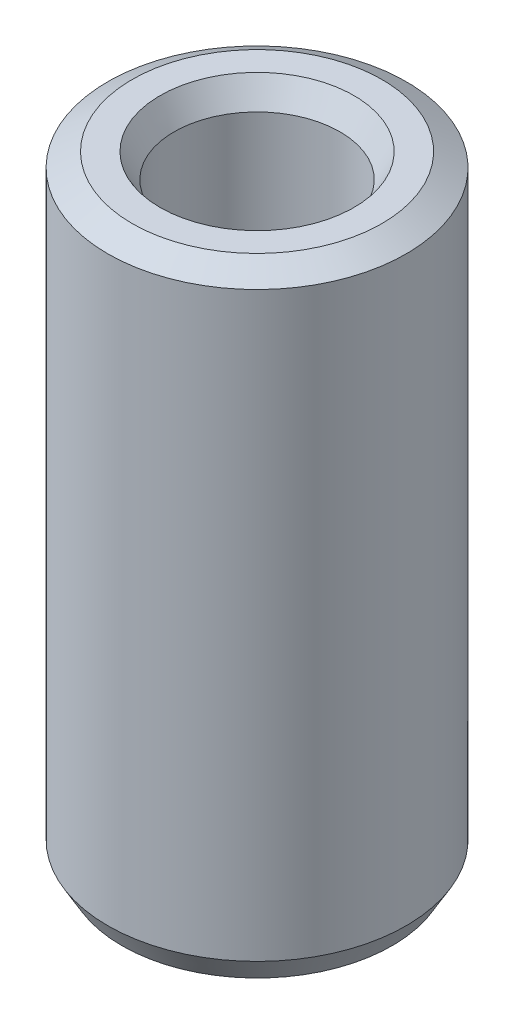
ISO-10303-21;
HEADER;
FILE_DESCRIPTION(('STEP AP214'),'2;1');
FILE_NAME('part.step','',(''),(''),'','','');
FILE_SCHEMA(('AUTOMOTIVE_DESIGN { 1 0 10303 214 1 1 1 1 }'));
ENDSEC;
DATA;
#1=APPLICATION_CONTEXT('core data for automotive mechanical design processes');
#2=APPLICATION_PROTOCOL_DEFINITION('international standard','automotive_design',2000,#1);
#3=PRODUCT_CONTEXT('',#1,'mechanical');
#4=PRODUCT('Part','Part','',(#3));
#5=PRODUCT_RELATED_PRODUCT_CATEGORY('part','',(#4));
#6=PRODUCT_DEFINITION_FORMATION('','',#4);
#7=PRODUCT_DEFINITION_CONTEXT('part definition',#1,'design');
#8=PRODUCT_DEFINITION('design','',#6,#7);
#9=PRODUCT_DEFINITION_SHAPE('','',#8);
#10=(LENGTH_UNIT() NAMED_UNIT(*) SI_UNIT(.MILLI.,.METRE.));
#11=(NAMED_UNIT(*) PLANE_ANGLE_UNIT() SI_UNIT($,.RADIAN.));
#12=(NAMED_UNIT(*) SI_UNIT($,.STERADIAN.) SOLID_ANGLE_UNIT());
#13=UNCERTAINTY_MEASURE_WITH_UNIT(LENGTH_MEASURE(1.E-05),#10,'distance_accuracy_value','');
#14=(GEOMETRIC_REPRESENTATION_CONTEXT(3) GLOBAL_UNCERTAINTY_ASSIGNED_CONTEXT((#13)) GLOBAL_UNIT_ASSIGNED_CONTEXT((#10,
#11,#12)) REPRESENTATION_CONTEXT('',''));
#15=CARTESIAN_POINT('',(0.,0.,0.));
#16=DIRECTION('',(0.,0.,1.));
#17=DIRECTION('',(1.,0.,0.));
#18=AXIS2_PLACEMENT_3D('',#15,#16,#17);
#19=CARTESIAN_POINT('',(0.,20.7877151218434,0.));
#20=DIRECTION('',(0.,-1.,0.));
#21=DIRECTION('',(0.,0.,-1.));
#22=AXIS2_PLACEMENT_3D('',#19,#20,#21);
#23=CYLINDRICAL_SURFACE('',#22,5.);
#24=CARTESIAN_POINT('',(0.,0.815561076409597,0.));
#25=DIRECTION('',(0.,1.,0.));
#26=DIRECTION('',(0.,0.,1.));
#27=AXIS2_PLACEMENT_3D('',#24,#25,#26);
#28=CIRCLE('',#27,5.);
#29=CARTESIAN_POINT('',(0.,0.815561076409597,5.));
#30=VERTEX_POINT('',#29);
#31=EDGE_CURVE('E10',#30,#30,#28,.T.);
#32=ORIENTED_EDGE('',*,*,#31,.T.);
#33=EDGE_LOOP('',(#32));
#34=FACE_BOUND('',#33,.T.);
#35=CARTESIAN_POINT('',(0.,20.3168507148377,0.));
#36=DIRECTION('',(0.,1.,0.));
#37=DIRECTION('',(0.,0.,1.));
#38=AXIS2_PLACEMENT_3D('',#35,#36,#37);
#39=CIRCLE('',#38,5.);
#40=CARTESIAN_POINT('',(0.,20.3168507148377,5.));
#41=VERTEX_POINT('',#40);
#42=EDGE_CURVE('E50',#41,#41,#39,.F.);
#43=ORIENTED_EDGE('',*,*,#42,.T.);
#44=EDGE_LOOP('',(#43));
#45=FACE_BOUND('',#44,.T.);
#46=ADVANCED_FACE('F39',(#34,#45),#23,.T.);
#47=CARTESIAN_POINT('',(0.,20.7877151218434,0.));
#48=DIRECTION('',(0.,1.,0.));
#49=DIRECTION('',(0.,0.,1.));
#50=AXIS2_PLACEMENT_3D('',#47,#48,#49);
#51=PLANE('',#50);
#52=CARTESIAN_POINT('',(0.,20.7877151218434,0.));
#53=DIRECTION('',(0.,1.,0.));
#54=DIRECTION('',(0.,0.,1.));
#55=AXIS2_PLACEMENT_3D('',#52,#53,#54);
#56=CIRCLE('',#55,3.24967798674538);
#57=CARTESIAN_POINT('',(0.,20.7877151218434,3.24967798674538));
#58=VERTEX_POINT('',#57);
#59=EDGE_CURVE('E58',#58,#58,#56,.F.);
#60=ORIENTED_EDGE('',*,*,#59,.T.);
#61=EDGE_LOOP('',(#60));
#62=FACE_BOUND('',#61,.T.);
#63=CARTESIAN_POINT('',(0.,20.7877151218434,0.));
#64=DIRECTION('',(0.,1.,0.));
#65=DIRECTION('',(0.,0.,1.));
#66=AXIS2_PLACEMENT_3D('',#63,#64,#65);
#67=CIRCLE('',#66,4.1844389235904);
#68=CARTESIAN_POINT('',(0.,20.7877151218434,4.1844389235904));
#69=VERTEX_POINT('',#68);
#70=EDGE_CURVE('E61',#69,#69,#67,.T.);
#71=ORIENTED_EDGE('',*,*,#70,.T.);
#72=EDGE_LOOP('',(#71));
#73=FACE_BOUND('',#72,.T.);
#74=ADVANCED_FACE('F88',(#62,#73),#51,.T.);
#75=CARTESIAN_POINT('',(0.,0.,0.));
#76=DIRECTION('',(0.,1.,0.));
#77=DIRECTION('',(0.,0.,1.));
#78=AXIS2_PLACEMENT_3D('',#75,#76,#77);
#79=PLANE('',#78);
#80=CARTESIAN_POINT('',(0.,0.,0.));
#81=DIRECTION('',(0.,1.,0.));
#82=DIRECTION('',(0.,0.,1.));
#83=AXIS2_PLACEMENT_3D('',#80,#81,#82);
#84=CIRCLE('',#83,3.59437465614932);
#85=CARTESIAN_POINT('',(0.,0.,-3.59437465614932));
#86=VERTEX_POINT('',#85);
#87=EDGE_CURVE('E51',#86,#86,#84,.T.);
#88=ORIENTED_EDGE('',*,*,#87,.T.);
#89=EDGE_LOOP('',(#88));
#90=FACE_BOUND('',#89,.T.);
#91=CARTESIAN_POINT('',(0.,0.,0.));
#92=DIRECTION('',(0.,1.,0.));
#93=DIRECTION('',(0.,0.,1.));
#94=AXIS2_PLACEMENT_3D('',#91,#92,#93);
#95=CIRCLE('',#94,4.52913559299433);
#96=CARTESIAN_POINT('',(0.,0.,4.52913559299433));
#97=VERTEX_POINT('',#96);
#98=EDGE_CURVE('E54',#97,#97,#95,.F.);
#99=ORIENTED_EDGE('',*,*,#98,.T.);
#100=EDGE_LOOP('',(#99));
#101=FACE_BOUND('',#100,.T.);
#102=ADVANCED_FACE('F83',(#90,#101),#79,.F.);
#103=CARTESIAN_POINT('',(0.,20.7877151218434,0.));
#104=DIRECTION('',(0.,-1.,0.));
#105=DIRECTION('',(0.,0.,-1.));
#106=AXIS2_PLACEMENT_3D('',#103,#104,#105);
#107=CYLINDRICAL_SURFACE('',#106,2.77881357973972);
#108=CARTESIAN_POINT('',(0.,19.9721540454338,0.));
#109=DIRECTION('',(0.,1.,0.));
#110=DIRECTION('',(0.,0.,1.));
#111=AXIS2_PLACEMENT_3D('',#108,#109,#110);
#112=CIRCLE('',#111,2.77881357973972);
#113=CARTESIAN_POINT('',(0.,19.9721540454338,-2.77881357973972));
#114=VERTEX_POINT('',#113);
#115=EDGE_CURVE('E67',#114,#114,#112,.T.);
#116=CARTESIAN_POINT('',(0.,0.470864407005663,0.));
#117=DIRECTION('',(0.,1.,0.));
#118=DIRECTION('',(0.,0.,1.));
#119=AXIS2_PLACEMENT_3D('',#116,#117,#118);
#120=CIRCLE('',#119,2.77881357973972);
#121=CARTESIAN_POINT('',(0.,0.47086440700566,-2.77881357973972));
#122=VERTEX_POINT('',#121);
#123=EDGE_CURVE('E69',#122,#122,#120,.F.);
#124=CARTESIAN_POINT('',(0.,19.9721540454338,-2.77881357973972));
#125=CARTESIAN_POINT('',(0.,19.7690156117001,-2.77881357973972));
#126=CARTESIAN_POINT('',(0.,19.5658771779665,-2.77881357973972));
#127=CARTESIAN_POINT('',(0.,19.1596003104993,-2.77881357973972));
#128=CARTESIAN_POINT('',(0.,18.9564618767656,-2.77881357973972));
#129=CARTESIAN_POINT('',(0.,18.5501850092984,-2.77881357973972));
#130=CARTESIAN_POINT('',(0.,18.3470465755648,-2.77881357973972));
#131=CARTESIAN_POINT('',(0.,17.9407697080975,-2.77881357973972));
#132=CARTESIAN_POINT('',(0.,17.7376312743639,-2.77881357973972));
#133=CARTESIAN_POINT('',(0.,17.3313544068966,-2.77881357973972));
#134=CARTESIAN_POINT('',(0.,17.128215973163,-2.77881357973972));
#135=CARTESIAN_POINT('',(0.,16.7219391056958,-2.77881357973972));
#136=CARTESIAN_POINT('',(0.,16.5188006719621,-2.77881357973972));
#137=CARTESIAN_POINT('',(0.,16.1125238044949,-2.77881357973972));
#138=CARTESIAN_POINT('',(0.,15.9093853707612,-2.77881357973972));
#139=CARTESIAN_POINT('',(0.,15.503108503294,-2.77881357973972));
#140=CARTESIAN_POINT('',(0.,15.2999700695604,-2.77881357973972));
#141=CARTESIAN_POINT('',(0.,14.8936932020931,-2.77881357973972));
#142=CARTESIAN_POINT('',(0.,14.6905547683595,-2.77881357973972));
#143=CARTESIAN_POINT('',(0.,14.2842779008922,-2.77881357973972));
#144=CARTESIAN_POINT('',(0.,14.0811394671586,-2.77881357973972));
#145=CARTESIAN_POINT('',(0.,13.6748625996914,-2.77881357973972));
#146=CARTESIAN_POINT('',(0.,13.4717241659577,-2.77881357973972));
#147=CARTESIAN_POINT('',(0.,13.0654472984905,-2.77881357973972));
#148=CARTESIAN_POINT('',(0.,12.8623088647569,-2.77881357973972));
#149=CARTESIAN_POINT('',(0.,12.4560319972896,-2.77881357973972));
#150=CARTESIAN_POINT('',(0.,12.252893563556,-2.77881357973972));
#151=CARTESIAN_POINT('',(0.,11.8466166960887,-2.77881357973972));
#152=CARTESIAN_POINT('',(0.,11.6434782623551,-2.77881357973972));
#153=CARTESIAN_POINT('',(0.,11.2372013948878,-2.77881357973972));
#154=CARTESIAN_POINT('',(0.,11.0340629611542,-2.77881357973972));
#155=CARTESIAN_POINT('',(0.,10.627786093687,-2.77881357973972));
#156=CARTESIAN_POINT('',(0.,10.4246476599533,-2.77881357973972));
#157=CARTESIAN_POINT('',(0.,10.0183707924861,-2.77881357973972));
#158=CARTESIAN_POINT('',(0.,9.81523235875246,-2.77881357973972));
#159=CARTESIAN_POINT('',(0.,9.40895549128521,-2.77881357973972));
#160=CARTESIAN_POINT('',(0.,9.20581705755158,-2.77881357973972));
#161=CARTESIAN_POINT('',(0.,8.79954019008433,-2.77881357973972));
#162=CARTESIAN_POINT('',(0.,8.5964017563507,-2.77881357973972));
#163=CARTESIAN_POINT('',(0.,8.19012488888345,-2.77881357973972));
#164=CARTESIAN_POINT('',(0.,7.98698645514983,-2.77881357973972));
#165=CARTESIAN_POINT('',(0.,7.58070958768257,-2.77881357973972));
#166=CARTESIAN_POINT('',(0.,7.37757115394895,-2.77881357973972));
#167=CARTESIAN_POINT('',(0.,6.9712942864817,-2.77881357973972));
#168=CARTESIAN_POINT('',(0.,6.76815585274807,-2.77881357973972));
#169=CARTESIAN_POINT('',(0.,6.36187898528082,-2.77881357973972));
#170=CARTESIAN_POINT('',(0.,6.15874055154719,-2.77881357973972));
#171=CARTESIAN_POINT('',(0.,5.75246368407994,-2.77881357973972));
#172=CARTESIAN_POINT('',(0.,5.54932525034631,-2.77881357973972));
#173=CARTESIAN_POINT('',(0.,5.14304838287906,-2.77881357973972));
#174=CARTESIAN_POINT('',(0.,4.93990994914543,-2.77881357973972));
#175=CARTESIAN_POINT('',(0.,4.53363308167818,-2.77881357973972));
#176=CARTESIAN_POINT('',(0.,4.33049464794456,-2.77881357973972));
#177=CARTESIAN_POINT('',(0.,3.92421778047731,-2.77881357973972));
#178=CARTESIAN_POINT('',(0.,3.72107934674368,-2.77881357973972));
#179=CARTESIAN_POINT('',(0.,3.31480247927643,-2.77881357973972));
#180=CARTESIAN_POINT('',(0.,3.1116640455428,-2.77881357973972));
#181=CARTESIAN_POINT('',(0.,2.70538717807555,-2.77881357973972));
#182=CARTESIAN_POINT('',(0.,2.50224874434192,-2.77881357973972));
#183=CARTESIAN_POINT('',(0.,2.09597187687467,-2.77881357973972));
#184=CARTESIAN_POINT('',(0.,1.89283344314104,-2.77881357973972));
#185=CARTESIAN_POINT('',(0.,1.48655657567379,-2.77881357973972));
#186=CARTESIAN_POINT('',(0.,1.28341814194016,-2.77881357973972));
#187=CARTESIAN_POINT('',(0.,0.877141274472912,-2.77881357973972));
#188=CARTESIAN_POINT('',(0.,0.674002840739286,-2.77881357973972));
#189=CARTESIAN_POINT('',(0.,0.47086440700566,-2.77881357973972));
#190=B_SPLINE_CURVE_WITH_KNOTS('',3,(#124,#125,#126,#127,#128,#129,#130,#131,#132,#133,#134,
#135,#136,#137,#138,#139,#140,#141,#142,#143,#144,#145,#146,#147,#148,#149,#150,#151,#152,#153,
#154,#155,#156,#157,#158,#159,#160,#161,#162,#163,#164,#165,#166,#167,#168,#169,#170,#171,#172,
#173,#174,#175,#176,#177,#178,#179,#180,#181,#182,#183,#184,#185,#186,#187,#188,#189),
.UNSPECIFIED.,.F.,.F.,(4,2,2,2,2,2,2,2,2,2,2,2,2,2,2,2,2,2,2,2,2,2,2,2,2,2,2,2,2,2,2,2,4),(0.,
0.609415301200879,1.21883060240176,1.82824590360264,2.43766120480351,3.04707650600439,
3.65649180720527,4.26590710840615,4.87532240960703,5.48473771080791,6.09415301200879,
6.70356831320967,7.31298361441055,7.92239891561142,8.5318142168123,9.14122951801318,
9.75064481921406,10.3600601204149,10.9694754216158,11.5788907228167,12.1883060240176,
12.7977213252185,13.4071366264193,14.0165519276202,14.6259672288211,15.235382530022,
15.8447978312228,16.4542131324237,17.0636284336246,17.6730437348255,18.2824590360264,
18.8918743372272,19.5012896384281),.UNSPECIFIED.);
#191=EDGE_CURVE('BSEAM71',#114,#122,#190,.T.);
#192=ORIENTED_EDGE('',*,*,#115,.T.);
#193=ORIENTED_EDGE('',*,*,#123,.T.);
#194=ORIENTED_EDGE('',*,*,#191,.T.);
#195=ORIENTED_EDGE('',*,*,#191,.F.);
#196=EDGE_LOOP('',(#192,#194,#193,#195));
#197=FACE_BOUND('',#196,.T.);
#198=ADVANCED_FACE('F71',(#197),#107,.F.);
#199=CARTESIAN_POINT('',(0.,19.9721540454338,0.));
#200=DIRECTION('',(0.,1.,0.));
#201=DIRECTION('',(0.,0.,1.));
#202=AXIS2_PLACEMENT_3D('',#199,#200,#201);
#203=CONICAL_SURFACE('',#202,2.77881357973972,0.523598775598299);
#204=ORIENTED_EDGE('',*,*,#59,.F.);
#205=EDGE_LOOP('',(#204));
#206=FACE_BOUND('',#205,.T.);
#207=ORIENTED_EDGE('',*,*,#115,.F.);
#208=EDGE_LOOP('',(#207));
#209=FACE_BOUND('',#208,.T.);
#210=ADVANCED_FACE('F77',(#206,#209),#203,.F.);
#211=CARTESIAN_POINT('',(0.,0.,0.));
#212=DIRECTION('',(0.,-1.,0.));
#213=DIRECTION('',(0.,0.,-1.));
#214=AXIS2_PLACEMENT_3D('',#211,#212,#213);
#215=CONICAL_SURFACE('',#214,3.59437465614932,1.04719755119659);
#216=CARTESIAN_POINT('',(0.,0.470864407005663,-2.77881357973972));
#217=CARTESIAN_POINT('',(0.,0.465959569432688,-2.78730900761899));
#218=CARTESIAN_POINT('',(0.,0.461054731859712,-2.79580443549826));
#219=CARTESIAN_POINT('',(0.,0.45124505671376,-2.81279529125679));
#220=CARTESIAN_POINT('',(0.,0.446340219140785,-2.82129071913606));
#221=CARTESIAN_POINT('',(0.,0.436530543994834,-2.83828157489459));
#222=CARTESIAN_POINT('',(0.,0.431625706421858,-2.84677700277386));
#223=CARTESIAN_POINT('',(0.,0.421816031275907,-2.86376785853239));
#224=CARTESIAN_POINT('',(0.,0.416911193702931,-2.87226328641166));
#225=CARTESIAN_POINT('',(0.,0.40710151855698,-2.88925414217019));
#226=CARTESIAN_POINT('',(0.,0.402196680984004,-2.89774957004946));
#227=CARTESIAN_POINT('',(0.,0.392387005838053,-2.91474042580799));
#228=CARTESIAN_POINT('',(0.,0.387482168265077,-2.92323585368726));
#229=CARTESIAN_POINT('',(0.,0.377672493119126,-2.94022670944579));
#230=CARTESIAN_POINT('',(0.,0.37276765554615,-2.94872213732506));
#231=CARTESIAN_POINT('',(0.,0.362957980400199,-2.96571299308359));
#232=CARTESIAN_POINT('',(0.,0.358053142827223,-2.97420842096286));
#233=CARTESIAN_POINT('',(0.,0.348243467681272,-2.99119927672139));
#234=CARTESIAN_POINT('',(0.,0.343338630108296,-2.99969470460066));
#235=CARTESIAN_POINT('',(0.,0.333528954962345,-3.01668556035919));
#236=CARTESIAN_POINT('',(0.,0.328624117389369,-3.02518098823846));
#237=CARTESIAN_POINT('',(0.,0.318814442243418,-3.04217184399699));
#238=CARTESIAN_POINT('',(0.,0.313909604670442,-3.05066727187626));
#239=CARTESIAN_POINT('',(0.,0.304099929524491,-3.06765812763479));
#240=CARTESIAN_POINT('',(0.,0.299195091951515,-3.07615355551405));
#241=CARTESIAN_POINT('',(0.,0.289385416805564,-3.09314441127259));
#242=CARTESIAN_POINT('',(0.,0.284480579232588,-3.10163983915185));
#243=CARTESIAN_POINT('',(0.,0.274670904086637,-3.11863069491039));
#244=CARTESIAN_POINT('',(0.,0.269766066513661,-3.12712612278965));
#245=CARTESIAN_POINT('',(0.,0.25995639136771,-3.14411697854819));
#246=CARTESIAN_POINT('',(0.,0.255051553794734,-3.15261240642745));
#247=CARTESIAN_POINT('',(0.,0.245241878648783,-3.16960326218599));
#248=CARTESIAN_POINT('',(0.,0.240337041075807,-3.17809869006525));
#249=CARTESIAN_POINT('',(0.,0.230527365929856,-3.19508954582379));
#250=CARTESIAN_POINT('',(0.,0.22562252835688,-3.20358497370305));
#251=CARTESIAN_POINT('',(0.,0.215812853210929,-3.22057582946159));
#252=CARTESIAN_POINT('',(0.,0.210908015637953,-3.22907125734085));
#253=CARTESIAN_POINT('',(0.,0.201098340492002,-3.24606211309939));
#254=CARTESIAN_POINT('',(0.,0.196193502919026,-3.25455754097865));
#255=CARTESIAN_POINT('',(0.,0.186383827773075,-3.27154839673719));
#256=CARTESIAN_POINT('',(0.,0.181478990200099,-3.28004382461645));
#257=CARTESIAN_POINT('',(0.,0.171669315054148,-3.29703468037499));
#258=CARTESIAN_POINT('',(0.,0.166764477481172,-3.30553010825425));
#259=CARTESIAN_POINT('',(0.,0.156954802335221,-3.32252096401279));
#260=CARTESIAN_POINT('',(0.,0.152049964762245,-3.33101639189205));
#261=CARTESIAN_POINT('',(0.,0.142240289616294,-3.34800724765059));
#262=CARTESIAN_POINT('',(0.,0.137335452043318,-3.35650267552985));
#263=CARTESIAN_POINT('',(0.,0.127525776897367,-3.37349353128839));
#264=CARTESIAN_POINT('',(0.,0.122620939324391,-3.38198895916765));
#265=CARTESIAN_POINT('',(0.,0.11281126417844,-3.39897981492618));
#266=CARTESIAN_POINT('',(0.,0.107906426605464,-3.40747524280545));
#267=CARTESIAN_POINT('',(0.,0.0980967514595132,-3.42446609856398));
#268=CARTESIAN_POINT('',(0.,0.0931919138865375,-3.43296152644325));
#269=CARTESIAN_POINT('',(0.,0.0833822387405862,-3.44995238220178));
#270=CARTESIAN_POINT('',(0.,0.0784774011676105,-3.45844781008105));
#271=CARTESIAN_POINT('',(0.,0.0686677260216592,-3.47543866583958));
#272=CARTESIAN_POINT('',(0.,0.0637628884486835,-3.48393409371885));
#273=CARTESIAN_POINT('',(0.,0.0539532133027322,-3.50092494947738));
#274=CARTESIAN_POINT('',(0.,0.0490483757297566,-3.50942037735665));
#275=CARTESIAN_POINT('',(0.,0.0392387005838053,-3.52641123311518));
#276=CARTESIAN_POINT('',(0.,0.0343338630108296,-3.53490666099445));
#277=CARTESIAN_POINT('',(0.,0.0245241878648783,-3.55189751675298));
#278=CARTESIAN_POINT('',(0.,0.0196193502919026,-3.56039294463225));
#279=CARTESIAN_POINT('',(0.,0.00980967514595132,-3.57738380039078));
#280=CARTESIAN_POINT('',(0.,0.00490483757297565,-3.58587922827005));
#281=CARTESIAN_POINT('',(0.,0.,-3.59437465614932));
#282=B_SPLINE_CURVE_WITH_KNOTS('',3,(#216,#217,#218,#219,#220,#221,#222,#223,#224,#225,#226,
#227,#228,#229,#230,#231,#232,#233,#234,#235,#236,#237,#238,#239,#240,#241,#242,#243,#244,#245,
#246,#247,#248,#249,#250,#251,#252,#253,#254,#255,#256,#257,#258,#259,#260,#261,#262,#263,#264,
#265,#266,#267,#268,#269,#270,#271,#272,#273,#274,#275,#276,#277,#278,#279,#280,#281),
.UNSPECIFIED.,.F.,.F.,(4,2,2,2,2,2,2,2,2,2,2,2,2,2,2,2,2,2,2,2,2,2,2,2,2,2,2,2,2,2,2,2,4),(0.,
0.0294290254378538,0.0588580508757076,0.0882870763135613,0.117716101751415,0.147145127189269,
0.176574152627122,0.206003178064976,0.23543220350283,0.264861228940684,0.294290254378537,
0.323719279816391,0.353148305254245,0.382577330692099,0.412006356129953,0.441435381567806,
0.47086440700566,0.500293432443514,0.529722457881367,0.559151483319221,0.588580508757075,
0.618009534194929,0.647438559632782,0.676867585070636,0.70629661050849,0.735725635946343,
0.765154661384197,0.794583686822051,0.824012712259904,0.853441737697758,0.882870763135612,
0.912299788573465,0.941728814011319),.UNSPECIFIED.);
#283=EDGE_CURVE('BSEAM73',#122,#86,#282,.T.);
#284=ORIENTED_EDGE('',*,*,#123,.F.);
#285=ORIENTED_EDGE('',*,*,#87,.F.);
#286=ORIENTED_EDGE('',*,*,#283,.T.);
#287=ORIENTED_EDGE('',*,*,#283,.F.);
#288=EDGE_LOOP('',(#284,#286,#285,#287));
#289=FACE_BOUND('',#288,.T.);
#290=ADVANCED_FACE('F73',(#289),#215,.F.);
#291=CARTESIAN_POINT('',(0.,0.815561076409597,0.));
#292=DIRECTION('',(0.,1.,0.));
#293=DIRECTION('',(0.,0.,1.));
#294=AXIS2_PLACEMENT_3D('',#291,#292,#293);
#295=CONICAL_SURFACE('',#294,5.,0.523598775598303);
#296=CARTESIAN_POINT('',(0.,0.,4.52913559299433));
#297=CARTESIAN_POINT('',(0.,0.00849542787926653,4.53404043056731));
#298=CARTESIAN_POINT('',(0.,0.0169908557585332,4.53894526814029));
#299=CARTESIAN_POINT('',(0.,0.0339817115170664,4.54875494328624));
#300=CARTESIAN_POINT('',(0.,0.0424771393963331,4.55365978085921));
#301=CARTESIAN_POINT('',(0.,0.0594679951548663,4.56346945600516));
#302=CARTESIAN_POINT('',(0.,0.067963423034133,4.56837429357814));
#303=CARTESIAN_POINT('',(0.,0.0849542787926662,4.57818396872409));
#304=CARTESIAN_POINT('',(0.,0.0934497066719329,4.58308880629707));
#305=CARTESIAN_POINT('',(0.,0.110440562430466,4.59289848144302));
#306=CARTESIAN_POINT('',(0.,0.118935990309733,4.59780331901599));
#307=CARTESIAN_POINT('',(0.,0.135926846068266,4.60761299416195));
#308=CARTESIAN_POINT('',(0.,0.144422273947533,4.61251783173492));
#309=CARTESIAN_POINT('',(0.,0.161413129706066,4.62232750688087));
#310=CARTESIAN_POINT('',(0.,0.169908557585333,4.62723234445385));
#311=CARTESIAN_POINT('',(0.,0.186899413343866,4.6370420195998));
#312=CARTESIAN_POINT('',(0.,0.195394841223132,4.64194685717278));
#313=CARTESIAN_POINT('',(0.,0.212385696981666,4.65175653231873));
#314=CARTESIAN_POINT('',(0.,0.220881124860932,4.6566613698917));
#315=CARTESIAN_POINT('',(0.,0.237871980619466,4.66647104503765));
#316=CARTESIAN_POINT('',(0.,0.246367408498732,4.67137588261063));
#317=CARTESIAN_POINT('',(0.,0.263358264257266,4.68118555775658));
#318=CARTESIAN_POINT('',(0.,0.271853692136532,4.68609039532956));
#319=CARTESIAN_POINT('',(0.,0.288844547895066,4.69590007047551));
#320=CARTESIAN_POINT('',(0.,0.297339975774332,4.70080490804848));
#321=CARTESIAN_POINT('',(0.,0.314330831532865,4.71061458319443));
#322=CARTESIAN_POINT('',(0.,0.322826259412132,4.71551942076741));
#323=CARTESIAN_POINT('',(0.,0.339817115170665,4.72532909591336));
#324=CARTESIAN_POINT('',(0.,0.348312543049932,4.73023393348634));
#325=CARTESIAN_POINT('',(0.,0.365303398808465,4.74004360863229));
#326=CARTESIAN_POINT('',(0.,0.373798826687732,4.74494844620527));
#327=CARTESIAN_POINT('',(0.,0.390789682446265,4.75475812135122));
#328=CARTESIAN_POINT('',(0.,0.399285110325532,4.75966295892419));
#329=CARTESIAN_POINT('',(0.,0.416275966084065,4.76947263407014));
#330=CARTESIAN_POINT('',(0.,0.424771393963332,4.77437747164312));
#331=CARTESIAN_POINT('',(0.,0.441762249721865,4.78418714678907));
#332=CARTESIAN_POINT('',(0.,0.450257677601132,4.78909198436205));
#333=CARTESIAN_POINT('',(0.,0.467248533359665,4.798901659508));
#334=CARTESIAN_POINT('',(0.,0.475743961238931,4.80380649708097));
#335=CARTESIAN_POINT('',(0.,0.492734816997465,4.81361617222692));
#336=CARTESIAN_POINT('',(0.,0.501230244876731,4.8185210097999));
#337=CARTESIAN_POINT('',(0.,0.518221100635265,4.82833068494585));
#338=CARTESIAN_POINT('',(0.,0.526716528514531,4.83323552251883));
#339=CARTESIAN_POINT('',(0.,0.543707384273065,4.84304519766478));
#340=CARTESIAN_POINT('',(0.,0.552202812152331,4.84795003523775));
#341=CARTESIAN_POINT('',(0.,0.569193667910864,4.8577597103837));
#342=CARTESIAN_POINT('',(0.,0.577689095790131,4.86266454795668));
#343=CARTESIAN_POINT('',(0.,0.594679951548664,4.87247422310263));
#344=CARTESIAN_POINT('',(0.,0.603175379427931,4.87737906067561));
#345=CARTESIAN_POINT('',(0.,0.620166235186464,4.88718873582156));
#346=CARTESIAN_POINT('',(0.,0.628661663065731,4.89209357339454));
#347=CARTESIAN_POINT('',(0.,0.645652518824264,4.90190324854049));
#348=CARTESIAN_POINT('',(0.,0.654147946703531,4.90680808611346));
#349=CARTESIAN_POINT('',(0.,0.671138802462064,4.91661776125941));
#350=CARTESIAN_POINT('',(0.,0.679634230341331,4.92152259883239));
#351=CARTESIAN_POINT('',(0.,0.696625086099864,4.93133227397834));
#352=CARTESIAN_POINT('',(0.,0.705120513979131,4.93623711155132));
#353=CARTESIAN_POINT('',(0.,0.722111369737664,4.94604678669727));
#354=CARTESIAN_POINT('',(0.,0.73060679761693,4.95095162427024));
#355=CARTESIAN_POINT('',(0.,0.747597653375464,4.96076129941619));
#356=CARTESIAN_POINT('',(0.,0.75609308125473,4.96566613698917));
#357=CARTESIAN_POINT('',(0.,0.773083937013264,4.97547581213512));
#358=CARTESIAN_POINT('',(0.,0.78157936489253,4.9803806497081));
#359=CARTESIAN_POINT('',(0.,0.798570220651063,4.99019032485405));
#360=CARTESIAN_POINT('',(0.,0.80706564853033,4.99509516242702));
#361=CARTESIAN_POINT('',(0.,0.815561076409597,5.));
#362=B_SPLINE_CURVE_WITH_KNOTS('',3,(#296,#297,#298,#299,#300,#301,#302,#303,#304,#305,#306,
#307,#308,#309,#310,#311,#312,#313,#314,#315,#316,#317,#318,#319,#320,#321,#322,#323,#324,#325,
#326,#327,#328,#329,#330,#331,#332,#333,#334,#335,#336,#337,#338,#339,#340,#341,#342,#343,#344,
#345,#346,#347,#348,#349,#350,#351,#352,#353,#354,#355,#356,#357,#358,#359,#360,#361),
.UNSPECIFIED.,.F.,.F.,(4,2,2,2,2,2,2,2,2,2,2,2,2,2,2,2,2,2,2,2,2,2,2,2,2,2,2,2,2,2,2,2,4),(0.,
0.0294290254378539,0.0588580508757079,0.0882870763135618,0.117716101751416,0.14714512718927,
0.176574152627124,0.206003178064978,0.235432203502831,0.264861228940685,0.294290254378539,
0.323719279816393,0.353148305254247,0.382577330692101,0.412006356129955,0.441435381567809,
0.470864407005663,0.500293432443517,0.52972245788137,0.559151483319224,0.588580508757078,
0.618009534194932,0.647438559632786,0.67686758507064,0.706296610508494,0.735725635946348,
0.765154661384202,0.794583686822056,0.82401271225991,0.853441737697764,0.882870763135618,
0.912299788573472,0.941728814011326),.UNSPECIFIED.);
#363=EDGE_CURVE('BSEAM76',#97,#30,#362,.T.);
#364=ORIENTED_EDGE('',*,*,#98,.F.);
#365=ORIENTED_EDGE('',*,*,#31,.F.);
#366=ORIENTED_EDGE('',*,*,#363,.T.);
#367=ORIENTED_EDGE('',*,*,#363,.F.);
#368=EDGE_LOOP('',(#364,#366,#365,#367));
#369=FACE_BOUND('',#368,.T.);
#370=ADVANCED_FACE('F76',(#369),#295,.T.);
#371=CARTESIAN_POINT('',(0.,20.7877151218434,0.));
#372=DIRECTION('',(0.,-1.,0.));
#373=DIRECTION('',(0.,0.,-1.));
#374=AXIS2_PLACEMENT_3D('',#371,#372,#373);
#375=CONICAL_SURFACE('',#374,4.1844389235904,1.04719755119659);
#376=ORIENTED_EDGE('',*,*,#42,.F.);
#377=EDGE_LOOP('',(#376));
#378=FACE_BOUND('',#377,.T.);
#379=ORIENTED_EDGE('',*,*,#70,.F.);
#380=EDGE_LOOP('',(#379));
#381=FACE_BOUND('',#380,.T.);
#382=ADVANCED_FACE('F45',(#378,#381),#375,.T.);
#383=CLOSED_SHELL('',(#46,#74,#102,#198,#210,#290,#370,#382));
#384=MANIFOLD_SOLID_BREP('B2',#383);
#385=ADVANCED_BREP_SHAPE_REPRESENTATION('',(#18,#384),#14);
#386=SHAPE_DEFINITION_REPRESENTATION(#9,#385);
ENDSEC;
END-ISO-10303-21;
